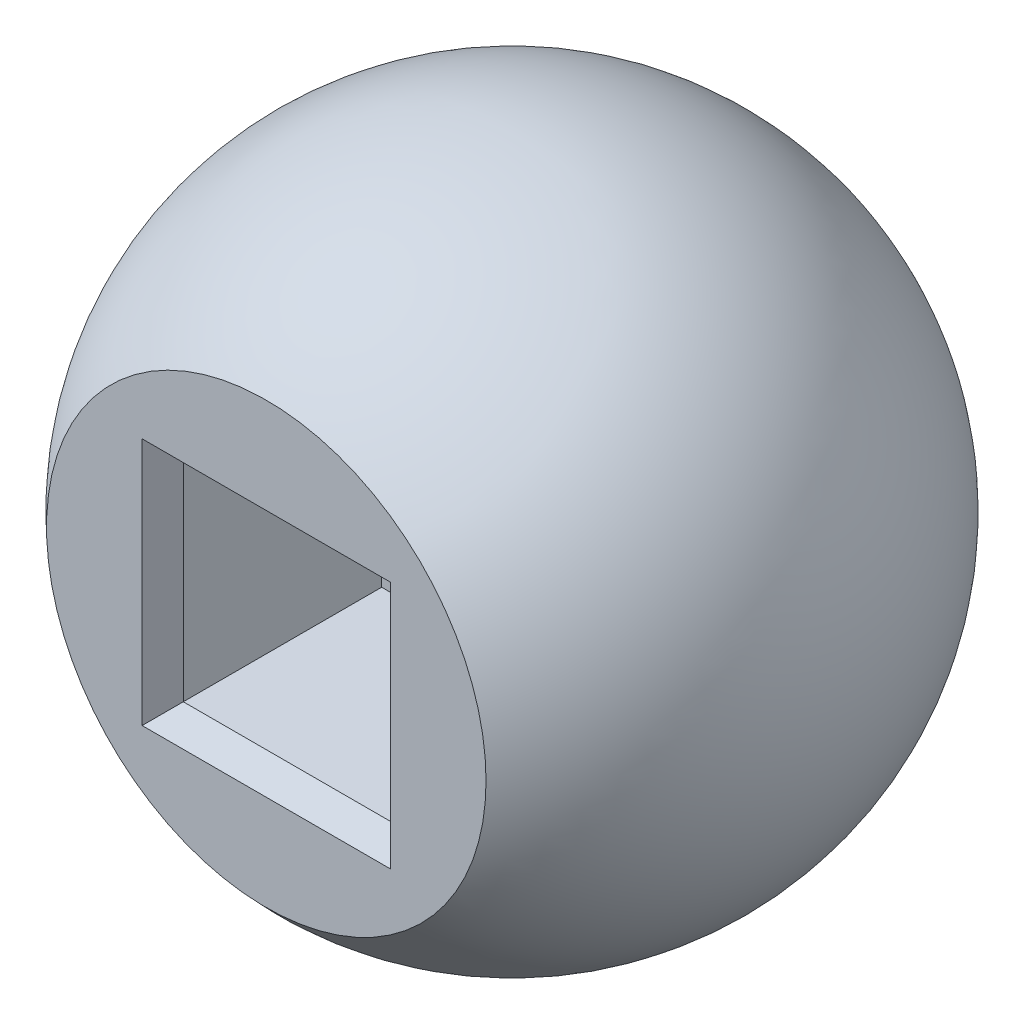
ISO-10303-21;
HEADER;
FILE_DESCRIPTION(('STEP AP214'),'2;1');
FILE_NAME('part.step','',(''),(''),'','','');
FILE_SCHEMA(('AUTOMOTIVE_DESIGN { 1 0 10303 214 1 1 1 1 }'));
ENDSEC;
DATA;
#1=APPLICATION_CONTEXT('core data for automotive mechanical design processes');
#2=APPLICATION_PROTOCOL_DEFINITION('international standard','automotive_design',2000,#1);
#3=PRODUCT_CONTEXT('',#1,'mechanical');
#4=PRODUCT('Part','Part','',(#3));
#5=PRODUCT_RELATED_PRODUCT_CATEGORY('part','',(#4));
#6=PRODUCT_DEFINITION_FORMATION('','',#4);
#7=PRODUCT_DEFINITION_CONTEXT('part definition',#1,'design');
#8=PRODUCT_DEFINITION('design','',#6,#7);
#9=PRODUCT_DEFINITION_SHAPE('','',#8);
#10=(LENGTH_UNIT() NAMED_UNIT(*) SI_UNIT(.MILLI.,.METRE.));
#11=(NAMED_UNIT(*) PLANE_ANGLE_UNIT() SI_UNIT($,.RADIAN.));
#12=(NAMED_UNIT(*) SI_UNIT($,.STERADIAN.) SOLID_ANGLE_UNIT());
#13=UNCERTAINTY_MEASURE_WITH_UNIT(LENGTH_MEASURE(1.E-05),#10,'distance_accuracy_value','');
#14=(GEOMETRIC_REPRESENTATION_CONTEXT(3) GLOBAL_UNCERTAINTY_ASSIGNED_CONTEXT((#13)) GLOBAL_UNIT_ASSIGNED_CONTEXT((#10,
#11,#12)) REPRESENTATION_CONTEXT('',''));
#15=CARTESIAN_POINT('',(0.,0.,0.));
#16=DIRECTION('',(0.,0.,1.));
#17=DIRECTION('',(1.,0.,0.));
#18=AXIS2_PLACEMENT_3D('',#15,#16,#17);
#19=CARTESIAN_POINT('',(0.,0.,0.));
#20=DIRECTION('',(0.,0.,1.));
#21=DIRECTION('',(1.,0.,0.));
#22=AXIS2_PLACEMENT_3D('',#19,#20,#21);
#23=SPHERICAL_SURFACE('',#22,15.);
#24=CARTESIAN_POINT('',(0.,0.,-14.3090880212542));
#25=DIRECTION('',(0.,0.,1.));
#26=DIRECTION('',(1.,0.,0.));
#27=AXIS2_PLACEMENT_3D('',#24,#25,#26);
#28=CIRCLE('',#27,4.5);
#29=CARTESIAN_POINT('',(4.5,0.,-14.3090880212542));
#30=VERTEX_POINT('',#29);
#31=EDGE_CURVE('E114',#30,#30,#28,.F.);
#32=ORIENTED_EDGE('',*,*,#31,.F.);
#33=EDGE_LOOP('',(#32));
#34=FACE_BOUND('',#33,.T.);
#35=CARTESIAN_POINT('',(0.,0.,11.1803398874989));
#36=DIRECTION('',(0.,0.,1.));
#37=DIRECTION('',(1.,0.,0.));
#38=AXIS2_PLACEMENT_3D('',#35,#36,#37);
#39=CIRCLE('',#38,10.);
#40=CARTESIAN_POINT('',(10.,0.,11.1803398874989));
#41=VERTEX_POINT('',#40);
#42=EDGE_CURVE('E122',#41,#41,#39,.T.);
#43=ORIENTED_EDGE('',*,*,#42,.F.);
#44=EDGE_LOOP('',(#43));
#45=FACE_BOUND('',#44,.T.);
#46=ADVANCED_FACE('F34',(#34,#45),#23,.T.);
#47=CARTESIAN_POINT('',(0.,0.,11.1803398874989));
#48=DIRECTION('',(0.,0.,1.));
#49=DIRECTION('',(1.,0.,0.));
#50=AXIS2_PLACEMENT_3D('',#47,#48,#49);
#51=PLANE('',#50);
#52=DIRECTION('',(0.,1.,0.));
#53=VECTOR('',#52,1.);
#54=CARTESIAN_POINT('',(-5.65,5.15,11.180339887499));
#55=LINE('',#54,#53);
#56=CARTESIAN_POINT('',(-5.65,-5.65,11.180339887499));
#57=VERTEX_POINT('',#56);
#58=CARTESIAN_POINT('',(-5.65,5.65,11.180339887499));
#59=VERTEX_POINT('',#58);
#60=EDGE_CURVE('E136',#57,#59,#55,.T.);
#61=ORIENTED_EDGE('',*,*,#60,.T.);
#62=DIRECTION('',(1.,0.,0.));
#63=VECTOR('',#62,1.);
#64=CARTESIAN_POINT('',(5.15,5.65,11.1803398874989));
#65=LINE('',#64,#63);
#66=CARTESIAN_POINT('',(5.65,5.65,11.1803398874989));
#67=VERTEX_POINT('',#66);
#68=EDGE_CURVE('E142',#59,#67,#65,.T.);
#69=ORIENTED_EDGE('',*,*,#68,.T.);
#70=DIRECTION('',(0.,-1.,0.));
#71=VECTOR('',#70,1.);
#72=CARTESIAN_POINT('',(5.65,-5.15,11.1803398874989));
#73=LINE('',#72,#71);
#74=CARTESIAN_POINT('',(5.65,-5.65,11.1803398874989));
#75=VERTEX_POINT('',#74);
#76=EDGE_CURVE('E140',#67,#75,#73,.T.);
#77=ORIENTED_EDGE('',*,*,#76,.T.);
#78=DIRECTION('',(-1.,0.,0.));
#79=VECTOR('',#78,1.);
#80=CARTESIAN_POINT('',(-5.15,-5.65,11.180339887499));
#81=LINE('',#80,#79);
#82=EDGE_CURVE('E138',#75,#57,#81,.T.);
#83=ORIENTED_EDGE('',*,*,#82,.T.);
#84=EDGE_LOOP('',(#61,#69,#77,#83));
#85=FACE_BOUND('',#84,.T.);
#86=ORIENTED_EDGE('',*,*,#42,.T.);
#87=EDGE_LOOP('',(#86));
#88=FACE_BOUND('',#87,.T.);
#89=ADVANCED_FACE('F185',(#85,#88),#51,.T.);
#90=CARTESIAN_POINT('',(5.15,-5.15,0.780339887498949));
#91=DIRECTION('',(1.,0.,0.));
#92=DIRECTION('',(0.,0.,-1.));
#93=AXIS2_PLACEMENT_3D('',#90,#91,#92);
#94=PLANE('',#93);
#95=DIRECTION('',(0.,0.,1.));
#96=VECTOR('',#95,1.);
#97=CARTESIAN_POINT('',(5.15,-5.15,0.780339887498949));
#98=LINE('',#97,#96);
#99=CARTESIAN_POINT('',(5.15,-5.15,0.780339887498949));
#100=VERTEX_POINT('',#99);
#101=CARTESIAN_POINT('',(5.15,-5.15,9.80660117777165));
#102=VERTEX_POINT('',#101);
#103=EDGE_CURVE('E120',#100,#102,#98,.T.);
#104=ORIENTED_EDGE('',*,*,#103,.T.);
#105=DIRECTION('',(0.,1.,0.));
#106=VECTOR('',#105,1.);
#107=CARTESIAN_POINT('',(5.15,5.15,9.80660117777164));
#108=LINE('',#107,#106);
#109=CARTESIAN_POINT('',(5.15,5.15,9.80660117777164));
#110=VERTEX_POINT('',#109);
#111=EDGE_CURVE('E94',#102,#110,#108,.T.);
#112=ORIENTED_EDGE('',*,*,#111,.T.);
#113=DIRECTION('',(0.,0.,1.));
#114=VECTOR('',#113,1.);
#115=CARTESIAN_POINT('',(5.15,5.15,0.780339887498949));
#116=LINE('',#115,#114);
#117=CARTESIAN_POINT('',(5.15,5.15,0.780339887498949));
#118=VERTEX_POINT('',#117);
#119=EDGE_CURVE('E87',#118,#110,#116,.T.);
#120=ORIENTED_EDGE('',*,*,#119,.F.);
#121=DIRECTION('',(0.,1.,0.));
#122=VECTOR('',#121,1.);
#123=CARTESIAN_POINT('',(5.15,-5.15,0.780339887498949));
#124=LINE('',#123,#122);
#125=EDGE_CURVE('E91',#100,#118,#124,.T.);
#126=ORIENTED_EDGE('',*,*,#125,.F.);
#127=EDGE_LOOP('',(#104,#112,#120,#126));
#128=FACE_BOUND('',#127,.T.);
#129=ADVANCED_FACE('F89',(#128),#94,.F.);
#130=CARTESIAN_POINT('',(-5.15,-5.15,0.780339887498949));
#131=DIRECTION('',(0.,-1.,0.));
#132=DIRECTION('',(0.,0.,-1.));
#133=AXIS2_PLACEMENT_3D('',#130,#131,#132);
#134=PLANE('',#133);
#135=DIRECTION('',(0.,0.,1.));
#136=VECTOR('',#135,1.);
#137=CARTESIAN_POINT('',(-5.15,-5.15,0.780339887498949));
#138=LINE('',#137,#136);
#139=CARTESIAN_POINT('',(-5.15,-5.15,0.780339887498949));
#140=VERTEX_POINT('',#139);
#141=CARTESIAN_POINT('',(-5.15,-5.15,9.80660117777165));
#142=VERTEX_POINT('',#141);
#143=EDGE_CURVE('E123',#140,#142,#138,.T.);
#144=ORIENTED_EDGE('',*,*,#143,.T.);
#145=DIRECTION('',(1.,0.,0.));
#146=VECTOR('',#145,1.);
#147=CARTESIAN_POINT('',(5.15,-5.15,9.80660117777165));
#148=LINE('',#147,#146);
#149=EDGE_CURVE('E43',#142,#102,#148,.T.);
#150=ORIENTED_EDGE('',*,*,#149,.T.);
#151=ORIENTED_EDGE('',*,*,#103,.F.);
#152=DIRECTION('',(1.,0.,0.));
#153=VECTOR('',#152,1.);
#154=CARTESIAN_POINT('',(-5.15,-5.15,0.780339887498949));
#155=LINE('',#154,#153);
#156=EDGE_CURVE('E99',#140,#100,#155,.T.);
#157=ORIENTED_EDGE('',*,*,#156,.F.);
#158=EDGE_LOOP('',(#144,#150,#151,#157));
#159=FACE_BOUND('',#158,.T.);
#160=ADVANCED_FACE('F219',(#159),#134,.F.);
#161=CARTESIAN_POINT('',(-5.15,-5.15,0.780339887498949));
#162=DIRECTION('',(-1.,0.,0.));
#163=DIRECTION('',(0.,0.,1.));
#164=AXIS2_PLACEMENT_3D('',#161,#162,#163);
#165=PLANE('',#164);
#166=DIRECTION('',(0.,0.,1.));
#167=VECTOR('',#166,1.);
#168=CARTESIAN_POINT('',(-5.15,5.15,0.780339887498949));
#169=LINE('',#168,#167);
#170=CARTESIAN_POINT('',(-5.15,5.15,0.780339887498949));
#171=VERTEX_POINT('',#170);
#172=CARTESIAN_POINT('',(-5.15,5.15,9.80660117777165));
#173=VERTEX_POINT('',#172);
#174=EDGE_CURVE('E98',#171,#173,#169,.T.);
#175=ORIENTED_EDGE('',*,*,#174,.T.);
#176=DIRECTION('',(0.,-1.,0.));
#177=VECTOR('',#176,1.);
#178=CARTESIAN_POINT('',(-5.15,-5.15,9.80660117777165));
#179=LINE('',#178,#177);
#180=EDGE_CURVE('E11',#173,#142,#179,.T.);
#181=ORIENTED_EDGE('',*,*,#180,.T.);
#182=ORIENTED_EDGE('',*,*,#143,.F.);
#183=DIRECTION('',(0.,-1.,0.));
#184=VECTOR('',#183,1.);
#185=CARTESIAN_POINT('',(-5.15,-5.15,0.780339887498949));
#186=LINE('',#185,#184);
#187=EDGE_CURVE('E107',#171,#140,#186,.T.);
#188=ORIENTED_EDGE('',*,*,#187,.F.);
#189=EDGE_LOOP('',(#175,#181,#182,#188));
#190=FACE_BOUND('',#189,.T.);
#191=ADVANCED_FACE('F181',(#190),#165,.F.);
#192=CARTESIAN_POINT('',(-5.15,5.15,0.780339887498949));
#193=DIRECTION('',(0.,1.,0.));
#194=DIRECTION('',(0.,0.,1.));
#195=AXIS2_PLACEMENT_3D('',#192,#193,#194);
#196=PLANE('',#195);
#197=ORIENTED_EDGE('',*,*,#119,.T.);
#198=DIRECTION('',(-1.,0.,0.));
#199=VECTOR('',#198,1.);
#200=CARTESIAN_POINT('',(-5.15,5.15,9.80660117777165));
#201=LINE('',#200,#199);
#202=EDGE_CURVE('E128',#110,#173,#201,.T.);
#203=ORIENTED_EDGE('',*,*,#202,.T.);
#204=ORIENTED_EDGE('',*,*,#174,.F.);
#205=DIRECTION('',(-1.,0.,0.));
#206=VECTOR('',#205,1.);
#207=CARTESIAN_POINT('',(-5.15,5.15,0.780339887498949));
#208=LINE('',#207,#206);
#209=EDGE_CURVE('E102',#118,#171,#208,.T.);
#210=ORIENTED_EDGE('',*,*,#209,.F.);
#211=EDGE_LOOP('',(#197,#203,#204,#210));
#212=FACE_BOUND('',#211,.T.);
#213=ADVANCED_FACE('F103',(#212),#196,.F.);
#214=CARTESIAN_POINT('',(0.,0.,0.780339887498949));
#215=DIRECTION('',(0.,0.,-1.));
#216=DIRECTION('',(-1.,0.,0.));
#217=AXIS2_PLACEMENT_3D('',#214,#215,#216);
#218=PLANE('',#217);
#219=CARTESIAN_POINT('',(0.,0.,0.780339887498949));
#220=DIRECTION('',(0.,0.,1.));
#221=DIRECTION('',(1.,0.,0.));
#222=AXIS2_PLACEMENT_3D('',#219,#220,#221);
#223=CIRCLE('',#222,2.15);
#224=CARTESIAN_POINT('',(2.15,0.,0.780339887498949));
#225=VERTEX_POINT('',#224);
#226=EDGE_CURVE('E111',#225,#225,#223,.T.);
#227=ORIENTED_EDGE('',*,*,#226,.F.);
#228=EDGE_LOOP('',(#227));
#229=FACE_BOUND('',#228,.T.);
#230=ORIENTED_EDGE('',*,*,#125,.T.);
#231=ORIENTED_EDGE('',*,*,#209,.T.);
#232=ORIENTED_EDGE('',*,*,#187,.T.);
#233=ORIENTED_EDGE('',*,*,#156,.T.);
#234=EDGE_LOOP('',(#230,#231,#232,#233));
#235=FACE_BOUND('',#234,.T.);
#236=ADVANCED_FACE('F109',(#229,#235),#218,.F.);
#237=CARTESIAN_POINT('',(0.,0.,-15.));
#238=DIRECTION('',(0.,0.,1.));
#239=DIRECTION('',(1.,0.,0.));
#240=AXIS2_PLACEMENT_3D('',#237,#238,#239);
#241=CYLINDRICAL_SURFACE('',#240,2.15);
#242=CARTESIAN_POINT('',(0.,0.,-9.21966011250105));
#243=DIRECTION('',(0.,0.,1.));
#244=DIRECTION('',(1.,0.,0.));
#245=AXIS2_PLACEMENT_3D('',#242,#243,#244);
#246=CIRCLE('',#245,2.15);
#247=CARTESIAN_POINT('',(2.15,0.,-9.21966011250105));
#248=VERTEX_POINT('',#247);
#249=EDGE_CURVE('E129',#248,#248,#246,.F.);
#250=ORIENTED_EDGE('',*,*,#249,.T.);
#251=EDGE_LOOP('',(#250));
#252=FACE_BOUND('',#251,.T.);
#253=ORIENTED_EDGE('',*,*,#226,.T.);
#254=EDGE_LOOP('',(#253));
#255=FACE_BOUND('',#254,.T.);
#256=ADVANCED_FACE('F167',(#252,#255),#241,.F.);
#257=CARTESIAN_POINT('',(0.,0.,-9.21966011250105));
#258=DIRECTION('',(0.,0.,1.));
#259=DIRECTION('',(1.,0.,0.));
#260=AXIS2_PLACEMENT_3D('',#257,#258,#259);
#261=PLANE('',#260);
#262=CARTESIAN_POINT('',(0.,0.,-9.21966011250105));
#263=DIRECTION('',(0.,0.,1.));
#264=DIRECTION('',(1.,0.,0.));
#265=AXIS2_PLACEMENT_3D('',#262,#263,#264);
#266=CIRCLE('',#265,4.5);
#267=CARTESIAN_POINT('',(4.5,0.,-9.21966011250105));
#268=VERTEX_POINT('',#267);
#269=EDGE_CURVE('E132',#268,#268,#266,.T.);
#270=ORIENTED_EDGE('',*,*,#269,.F.);
#271=EDGE_LOOP('',(#270));
#272=FACE_BOUND('',#271,.T.);
#273=ORIENTED_EDGE('',*,*,#249,.F.);
#274=EDGE_LOOP('',(#273));
#275=FACE_BOUND('',#274,.T.);
#276=ADVANCED_FACE('F164',(#272,#275),#261,.F.);
#277=CARTESIAN_POINT('',(0.,0.,-14.8451170423139));
#278=DIRECTION('',(0.,0.,1.));
#279=DIRECTION('',(1.,0.,0.));
#280=AXIS2_PLACEMENT_3D('',#277,#278,#279);
#281=CYLINDRICAL_SURFACE('',#280,4.5);
#282=ORIENTED_EDGE('',*,*,#31,.T.);
#283=EDGE_LOOP('',(#282));
#284=FACE_BOUND('',#283,.T.);
#285=ORIENTED_EDGE('',*,*,#269,.T.);
#286=EDGE_LOOP('',(#285));
#287=FACE_BOUND('',#286,.T.);
#288=ADVANCED_FACE('F162',(#284,#287),#281,.F.);
#289=CARTESIAN_POINT('',(-5.15,-5.15,9.80660117777165));
#290=DIRECTION('',(0.,0.939692620785908,0.342020143325671));
#291=DIRECTION('',(-1.,0.,0.));
#292=AXIS2_PLACEMENT_3D('',#289,#290,#291);
#293=PLANE('',#292);
#294=DIRECTION('',(0.323615577118187,0.323615577118186,-0.889126490715987));
#295=VECTOR('',#294,1.);
#296=CARTESIAN_POINT('',(-5.15,-5.15,9.80660117777165));
#297=LINE('',#296,#295);
#298=EDGE_CURVE('E150',#57,#142,#297,.T.);
#299=ORIENTED_EDGE('',*,*,#298,.F.);
#300=ORIENTED_EDGE('',*,*,#82,.F.);
#301=DIRECTION('',(-0.323615577118186,0.323615577118187,-0.889126490715987));
#302=VECTOR('',#301,1.);
#303=CARTESIAN_POINT('',(5.15,-5.15,9.80660117777164));
#304=LINE('',#303,#302);
#305=EDGE_CURVE('E38',#102,#75,#304,.F.);
#306=ORIENTED_EDGE('',*,*,#305,.F.);
#307=ORIENTED_EDGE('',*,*,#149,.F.);
#308=EDGE_LOOP('',(#299,#300,#306,#307));
#309=FACE_BOUND('',#308,.T.);
#310=ADVANCED_FACE('F36',(#309),#293,.T.);
#311=CARTESIAN_POINT('',(5.15,-5.15,9.80660117777164));
#312=DIRECTION('',(-0.939692620785908,0.,0.34202014332567));
#313=DIRECTION('',(0.,-1.,0.));
#314=AXIS2_PLACEMENT_3D('',#311,#312,#313);
#315=PLANE('',#314);
#316=ORIENTED_EDGE('',*,*,#305,.T.);
#317=ORIENTED_EDGE('',*,*,#76,.F.);
#318=DIRECTION('',(-0.323615577118186,-0.323615577118187,-0.889126490715987));
#319=VECTOR('',#318,1.);
#320=CARTESIAN_POINT('',(4.07131146993857,4.07131146993857,6.8429287988032));
#321=LINE('',#320,#319);
#322=EDGE_CURVE('E149',#110,#67,#321,.F.);
#323=ORIENTED_EDGE('',*,*,#322,.F.);
#324=ORIENTED_EDGE('',*,*,#111,.F.);
#325=EDGE_LOOP('',(#316,#317,#323,#324));
#326=FACE_BOUND('',#325,.T.);
#327=ADVANCED_FACE('F203',(#326),#315,.T.);
#328=CARTESIAN_POINT('',(-5.15,-5.15,9.80660117777165));
#329=DIRECTION('',(0.939692620785908,0.,0.342020143325671));
#330=DIRECTION('',(0.,1.,0.));
#331=AXIS2_PLACEMENT_3D('',#328,#329,#330);
#332=PLANE('',#331);
#333=ORIENTED_EDGE('',*,*,#298,.T.);
#334=ORIENTED_EDGE('',*,*,#180,.F.);
#335=DIRECTION('',(-0.323615577118187,0.323615577118186,0.889126490715987));
#336=VECTOR('',#335,1.);
#337=CARTESIAN_POINT('',(-5.15,5.15,9.80660117777165));
#338=LINE('',#337,#336);
#339=EDGE_CURVE('E147',#59,#173,#338,.F.);
#340=ORIENTED_EDGE('',*,*,#339,.F.);
#341=ORIENTED_EDGE('',*,*,#60,.F.);
#342=EDGE_LOOP('',(#333,#334,#340,#341));
#343=FACE_BOUND('',#342,.T.);
#344=ADVANCED_FACE('F200',(#343),#332,.T.);
#345=CARTESIAN_POINT('',(-5.15,5.15,9.80660117777165));
#346=DIRECTION('',(0.,-0.939692620785908,0.342020143325671));
#347=DIRECTION('',(1.,0.,0.));
#348=AXIS2_PLACEMENT_3D('',#345,#346,#347);
#349=PLANE('',#348);
#350=ORIENTED_EDGE('',*,*,#322,.T.);
#351=ORIENTED_EDGE('',*,*,#68,.F.);
#352=ORIENTED_EDGE('',*,*,#339,.T.);
#353=ORIENTED_EDGE('',*,*,#202,.F.);
#354=EDGE_LOOP('',(#350,#351,#352,#353));
#355=FACE_BOUND('',#354,.T.);
#356=ADVANCED_FACE('F197',(#355),#349,.T.);
#357=CLOSED_SHELL('',(#46,#89,#129,#160,#191,#213,#236,#256,#276,#288,#310,#327,#344,#356));
#358=MANIFOLD_SOLID_BREP('B2',#357);
#359=ADVANCED_BREP_SHAPE_REPRESENTATION('',(#18,#358),#14);
#360=SHAPE_DEFINITION_REPRESENTATION(#9,#359);
ENDSEC;
END-ISO-10303-21;
